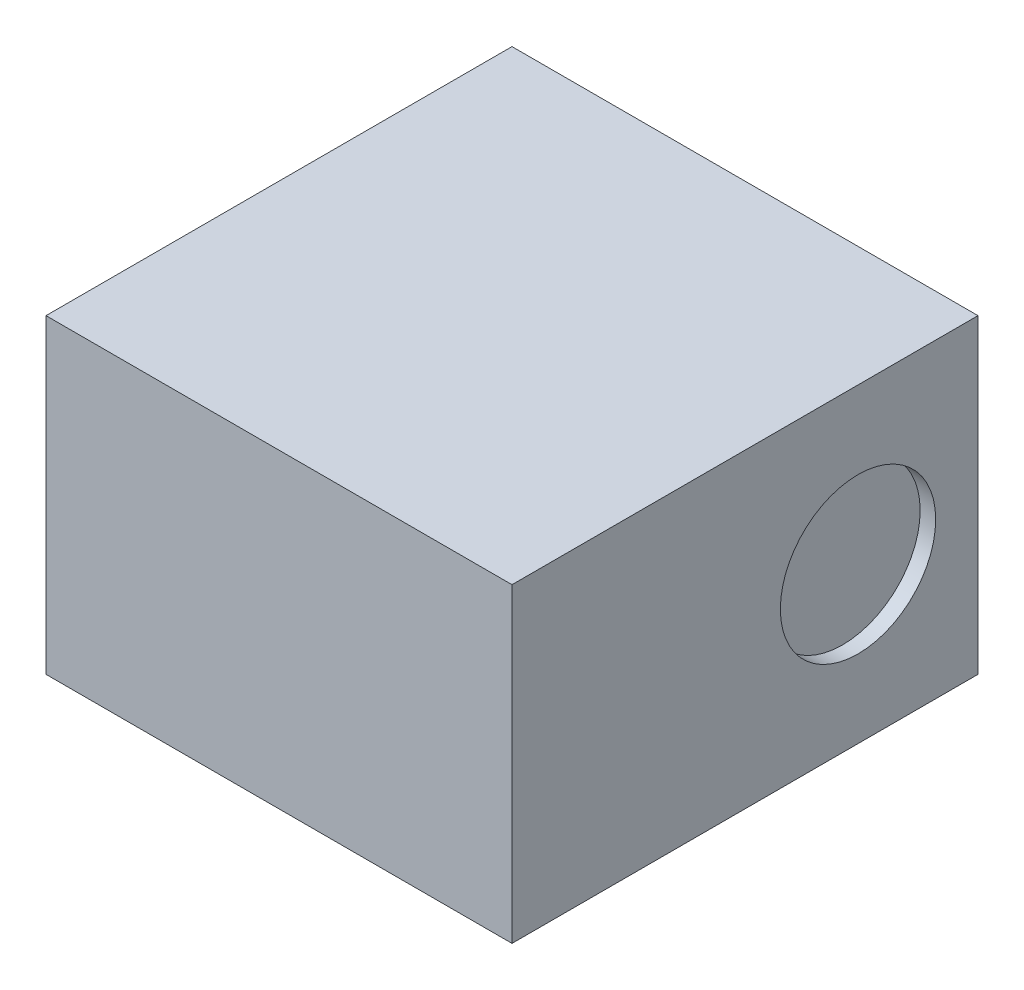
ISO-10303-21;
HEADER;
FILE_DESCRIPTION(('STEP AP214'),'2;1');
FILE_NAME('part.step','',(''),(''),'','','');
FILE_SCHEMA(('AUTOMOTIVE_DESIGN { 1 0 10303 214 1 1 1 1 }'));
ENDSEC;
DATA;
#1=APPLICATION_CONTEXT('core data for automotive mechanical design processes');
#2=APPLICATION_PROTOCOL_DEFINITION('international standard','automotive_design',2000,#1);
#3=PRODUCT_CONTEXT('',#1,'mechanical');
#4=PRODUCT('Part','Part','',(#3));
#5=PRODUCT_RELATED_PRODUCT_CATEGORY('part','',(#4));
#6=PRODUCT_DEFINITION_FORMATION('','',#4);
#7=PRODUCT_DEFINITION_CONTEXT('part definition',#1,'design');
#8=PRODUCT_DEFINITION('design','',#6,#7);
#9=PRODUCT_DEFINITION_SHAPE('','',#8);
#10=(LENGTH_UNIT() NAMED_UNIT(*) SI_UNIT(.MILLI.,.METRE.));
#11=(NAMED_UNIT(*) PLANE_ANGLE_UNIT() SI_UNIT($,.RADIAN.));
#12=(NAMED_UNIT(*) SI_UNIT($,.STERADIAN.) SOLID_ANGLE_UNIT());
#13=UNCERTAINTY_MEASURE_WITH_UNIT(LENGTH_MEASURE(1.E-05),#10,'distance_accuracy_value','');
#14=(GEOMETRIC_REPRESENTATION_CONTEXT(3) GLOBAL_UNCERTAINTY_ASSIGNED_CONTEXT((#13)) GLOBAL_UNIT_ASSIGNED_CONTEXT((#10,
#11,#12)) REPRESENTATION_CONTEXT('',''));
#15=CARTESIAN_POINT('',(0.,0.,0.));
#16=DIRECTION('',(0.,0.,1.));
#17=DIRECTION('',(1.,0.,0.));
#18=AXIS2_PLACEMENT_3D('',#15,#16,#17);
#19=CARTESIAN_POINT('',(-0.75,1.,-0.75));
#20=DIRECTION('',(1.,0.,0.));
#21=DIRECTION('',(0.,0.,-1.));
#22=AXIS2_PLACEMENT_3D('',#19,#20,#21);
#23=PLANE('',#22);
#24=DIRECTION('',(0.,0.,1.));
#25=VECTOR('',#24,1.);
#26=CARTESIAN_POINT('',(-0.75,0.,-0.75));
#27=LINE('',#26,#25);
#28=CARTESIAN_POINT('',(-0.75,0.,-0.75));
#29=VERTEX_POINT('',#28);
#30=CARTESIAN_POINT('',(-0.75,0.,0.75));
#31=VERTEX_POINT('',#30);
#32=EDGE_CURVE('E110',#29,#31,#27,.T.);
#33=ORIENTED_EDGE('',*,*,#32,.T.);
#34=DIRECTION('',(0.,-1.,0.));
#35=VECTOR('',#34,1.);
#36=CARTESIAN_POINT('',(-0.75,1.,0.75));
#37=LINE('',#36,#35);
#38=CARTESIAN_POINT('',(-0.75,1.,0.75));
#39=VERTEX_POINT('',#38);
#40=EDGE_CURVE('E11',#39,#31,#37,.T.);
#41=ORIENTED_EDGE('',*,*,#40,.F.);
#42=DIRECTION('',(0.,0.,1.));
#43=VECTOR('',#42,1.);
#44=CARTESIAN_POINT('',(-0.75,1.,-0.75));
#45=LINE('',#44,#43);
#46=CARTESIAN_POINT('',(-0.75,1.,-0.75));
#47=VERTEX_POINT('',#46);
#48=EDGE_CURVE('E93',#47,#39,#45,.T.);
#49=ORIENTED_EDGE('',*,*,#48,.F.);
#50=DIRECTION('',(0.,-1.,0.));
#51=VECTOR('',#50,1.);
#52=CARTESIAN_POINT('',(-0.75,1.,-0.75));
#53=LINE('',#52,#51);
#54=EDGE_CURVE('E106',#47,#29,#53,.T.);
#55=ORIENTED_EDGE('',*,*,#54,.T.);
#56=EDGE_LOOP('',(#33,#41,#49,#55));
#57=FACE_BOUND('',#56,.T.);
#58=ADVANCED_FACE('F41',(#57),#23,.F.);
#59=CARTESIAN_POINT('',(-0.75,1.,0.75));
#60=DIRECTION('',(0.,0.,-1.));
#61=DIRECTION('',(-1.,0.,0.));
#62=AXIS2_PLACEMENT_3D('',#59,#60,#61);
#63=PLANE('',#62);
#64=DIRECTION('',(1.,0.,0.));
#65=VECTOR('',#64,1.);
#66=CARTESIAN_POINT('',(-0.75,0.,0.75));
#67=LINE('',#66,#65);
#68=CARTESIAN_POINT('',(0.75,0.,0.75));
#69=VERTEX_POINT('',#68);
#70=EDGE_CURVE('E98',#31,#69,#67,.T.);
#71=ORIENTED_EDGE('',*,*,#70,.T.);
#72=DIRECTION('',(0.,-1.,0.));
#73=VECTOR('',#72,1.);
#74=CARTESIAN_POINT('',(0.75,1.,0.75));
#75=LINE('',#74,#73);
#76=CARTESIAN_POINT('',(0.75,1.,0.75));
#77=VERTEX_POINT('',#76);
#78=EDGE_CURVE('E50',#77,#69,#75,.T.);
#79=ORIENTED_EDGE('',*,*,#78,.F.);
#80=DIRECTION('',(1.,0.,0.));
#81=VECTOR('',#80,1.);
#82=CARTESIAN_POINT('',(-0.75,1.,0.75));
#83=LINE('',#82,#81);
#84=EDGE_CURVE('E88',#39,#77,#83,.T.);
#85=ORIENTED_EDGE('',*,*,#84,.F.);
#86=ORIENTED_EDGE('',*,*,#40,.T.);
#87=EDGE_LOOP('',(#71,#79,#85,#86));
#88=FACE_BOUND('',#87,.T.);
#89=ADVANCED_FACE('F97',(#88),#63,.F.);
#90=CARTESIAN_POINT('',(0.75,1.,-0.75));
#91=DIRECTION('',(-1.,0.,0.));
#92=DIRECTION('',(0.,0.,1.));
#93=AXIS2_PLACEMENT_3D('',#90,#91,#92);
#94=PLANE('',#93);
#95=CARTESIAN_POINT('',(0.75,0.5,-0.36380996590225));
#96=DIRECTION('',(1.,0.,0.));
#97=DIRECTION('',(0.,0.,-1.));
#98=AXIS2_PLACEMENT_3D('',#95,#96,#97);
#99=CIRCLE('',#98,0.25);
#100=CARTESIAN_POINT('',(0.75,0.5,-0.61380996590225));
#101=VERTEX_POINT('',#100);
#102=EDGE_CURVE('E130',#101,#101,#99,.T.);
#103=ORIENTED_EDGE('',*,*,#102,.F.);
#104=EDGE_LOOP('',(#103));
#105=FACE_BOUND('',#104,.T.);
#106=DIRECTION('',(0.,0.,-1.));
#107=VECTOR('',#106,1.);
#108=CARTESIAN_POINT('',(0.75,0.,-0.75));
#109=LINE('',#108,#107);
#110=CARTESIAN_POINT('',(0.75,0.,-0.75));
#111=VERTEX_POINT('',#110);
#112=EDGE_CURVE('E75',#69,#111,#109,.T.);
#113=ORIENTED_EDGE('',*,*,#112,.T.);
#114=DIRECTION('',(0.,-1.,0.));
#115=VECTOR('',#114,1.);
#116=CARTESIAN_POINT('',(0.75,1.,-0.75));
#117=LINE('',#116,#115);
#118=CARTESIAN_POINT('',(0.75,1.,-0.75));
#119=VERTEX_POINT('',#118);
#120=EDGE_CURVE('E100',#119,#111,#117,.T.);
#121=ORIENTED_EDGE('',*,*,#120,.F.);
#122=DIRECTION('',(0.,0.,-1.));
#123=VECTOR('',#122,1.);
#124=CARTESIAN_POINT('',(0.75,1.,-0.75));
#125=LINE('',#124,#123);
#126=EDGE_CURVE('E91',#77,#119,#125,.T.);
#127=ORIENTED_EDGE('',*,*,#126,.F.);
#128=ORIENTED_EDGE('',*,*,#78,.T.);
#129=EDGE_LOOP('',(#113,#121,#127,#128));
#130=FACE_BOUND('',#129,.T.);
#131=ADVANCED_FACE('F101',(#105,#130),#94,.F.);
#132=CARTESIAN_POINT('',(-0.75,1.,-0.75));
#133=DIRECTION('',(0.,0.,1.));
#134=DIRECTION('',(1.,0.,0.));
#135=AXIS2_PLACEMENT_3D('',#132,#133,#134);
#136=PLANE('',#135);
#137=DIRECTION('',(-1.,0.,0.));
#138=VECTOR('',#137,1.);
#139=CARTESIAN_POINT('',(-0.75,0.,-0.75));
#140=LINE('',#139,#138);
#141=EDGE_CURVE('E81',#111,#29,#140,.T.);
#142=ORIENTED_EDGE('',*,*,#141,.T.);
#143=ORIENTED_EDGE('',*,*,#54,.F.);
#144=DIRECTION('',(-1.,0.,0.));
#145=VECTOR('',#144,1.);
#146=CARTESIAN_POINT('',(-0.75,1.,-0.75));
#147=LINE('',#146,#145);
#148=EDGE_CURVE('E58',#119,#47,#147,.T.);
#149=ORIENTED_EDGE('',*,*,#148,.F.);
#150=ORIENTED_EDGE('',*,*,#120,.T.);
#151=EDGE_LOOP('',(#142,#143,#149,#150));
#152=FACE_BOUND('',#151,.T.);
#153=ADVANCED_FACE('F123',(#152),#136,.F.);
#154=CARTESIAN_POINT('',(0.,1.,0.));
#155=DIRECTION('',(0.,1.,0.));
#156=DIRECTION('',(0.,0.,1.));
#157=AXIS2_PLACEMENT_3D('',#154,#155,#156);
#158=PLANE('',#157);
#159=ORIENTED_EDGE('',*,*,#48,.T.);
#160=ORIENTED_EDGE('',*,*,#84,.T.);
#161=ORIENTED_EDGE('',*,*,#126,.T.);
#162=ORIENTED_EDGE('',*,*,#148,.T.);
#163=EDGE_LOOP('',(#159,#160,#161,#162));
#164=FACE_BOUND('',#163,.T.);
#165=ADVANCED_FACE('F89',(#164),#158,.T.);
#166=CARTESIAN_POINT('',(0.,0.,0.));
#167=DIRECTION('',(0.,1.,0.));
#168=DIRECTION('',(0.,0.,1.));
#169=AXIS2_PLACEMENT_3D('',#166,#167,#168);
#170=PLANE('',#169);
#171=ORIENTED_EDGE('',*,*,#32,.F.);
#172=ORIENTED_EDGE('',*,*,#141,.F.);
#173=ORIENTED_EDGE('',*,*,#112,.F.);
#174=ORIENTED_EDGE('',*,*,#70,.F.);
#175=EDGE_LOOP('',(#171,#172,#173,#174));
#176=FACE_BOUND('',#175,.T.);
#177=ADVANCED_FACE('F126',(#176),#170,.F.);
#178=CARTESIAN_POINT('',(0.7,0.5,-0.36380996590225));
#179=DIRECTION('',(1.,0.,0.));
#180=DIRECTION('',(0.,0.,-1.));
#181=AXIS2_PLACEMENT_3D('',#178,#179,#180);
#182=CYLINDRICAL_SURFACE('',#181,0.25);
#183=CARTESIAN_POINT('',(0.7,0.5,-0.36380996590225));
#184=DIRECTION('',(1.,0.,0.));
#185=DIRECTION('',(0.,0.,-1.));
#186=AXIS2_PLACEMENT_3D('',#183,#184,#185);
#187=CIRCLE('',#186,0.25);
#188=CARTESIAN_POINT('',(0.7,0.5,-0.61380996590225));
#189=VERTEX_POINT('',#188);
#190=EDGE_CURVE('E113',#189,#189,#187,.T.);
#191=ORIENTED_EDGE('',*,*,#190,.F.);
#192=EDGE_LOOP('',(#191));
#193=FACE_BOUND('',#192,.T.);
#194=ORIENTED_EDGE('',*,*,#102,.T.);
#195=EDGE_LOOP('',(#194));
#196=FACE_BOUND('',#195,.T.);
#197=ADVANCED_FACE('F140',(#193,#196),#182,.F.);
#198=CARTESIAN_POINT('',(0.7,0.5,-0.36380996590225));
#199=DIRECTION('',(1.,0.,0.));
#200=DIRECTION('',(0.,0.,-1.));
#201=AXIS2_PLACEMENT_3D('',#198,#199,#200);
#202=PLANE('',#201);
#203=ORIENTED_EDGE('',*,*,#190,.T.);
#204=EDGE_LOOP('',(#203));
#205=FACE_BOUND('',#204,.T.);
#206=ADVANCED_FACE('F138',(#205),#202,.T.);
#207=CLOSED_SHELL('',(#58,#89,#131,#153,#165,#177,#197,#206));
#208=MANIFOLD_SOLID_BREP('B2',#207);
#209=ADVANCED_BREP_SHAPE_REPRESENTATION('',(#18,#208),#14);
#210=SHAPE_DEFINITION_REPRESENTATION(#9,#209);
ENDSEC;
END-ISO-10303-21;
